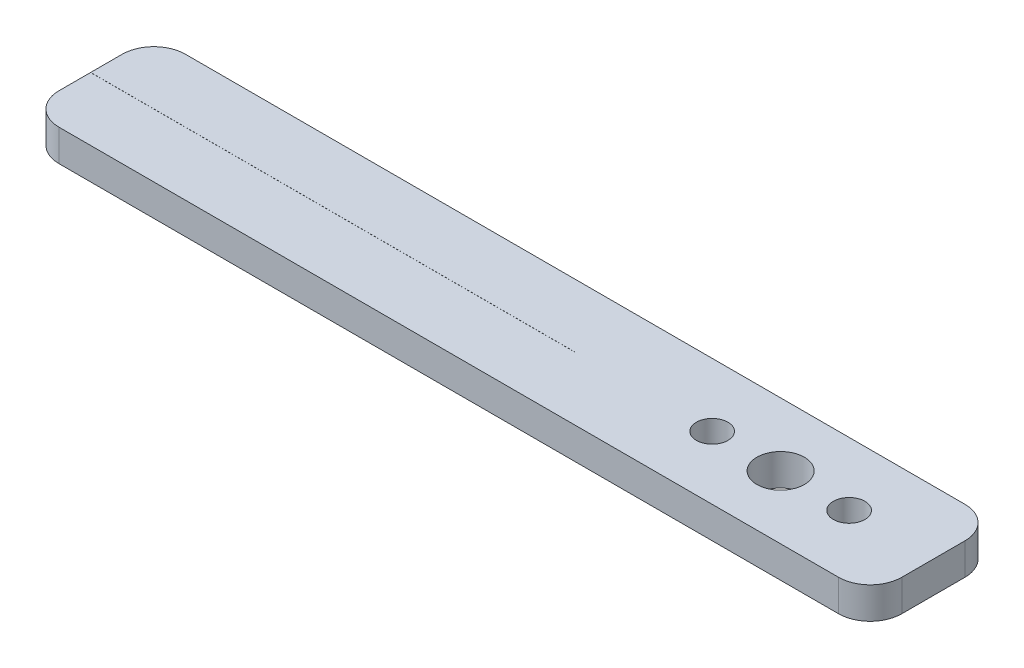
ISO-10303-21;
HEADER;
FILE_DESCRIPTION(('STEP AP214'),'2;1');
FILE_NAME('part.step','',(''),(''),'','','');
FILE_SCHEMA(('AUTOMOTIVE_DESIGN { 1 0 10303 214 1 1 1 1 }'));
ENDSEC;
DATA;
#1=APPLICATION_CONTEXT('core data for automotive mechanical design processes');
#2=APPLICATION_PROTOCOL_DEFINITION('international standard','automotive_design',2000,#1);
#3=PRODUCT_CONTEXT('',#1,'mechanical');
#4=PRODUCT('Part','Part','',(#3));
#5=PRODUCT_RELATED_PRODUCT_CATEGORY('part','',(#4));
#6=PRODUCT_DEFINITION_FORMATION('','',#4);
#7=PRODUCT_DEFINITION_CONTEXT('part definition',#1,'design');
#8=PRODUCT_DEFINITION('design','',#6,#7);
#9=PRODUCT_DEFINITION_SHAPE('','',#8);
#10=(LENGTH_UNIT() NAMED_UNIT(*) SI_UNIT(.MILLI.,.METRE.));
#11=(NAMED_UNIT(*) PLANE_ANGLE_UNIT() SI_UNIT($,.RADIAN.));
#12=(NAMED_UNIT(*) SI_UNIT($,.STERADIAN.) SOLID_ANGLE_UNIT());
#13=UNCERTAINTY_MEASURE_WITH_UNIT(LENGTH_MEASURE(1.E-05),#10,'distance_accuracy_value','');
#14=(GEOMETRIC_REPRESENTATION_CONTEXT(3) GLOBAL_UNCERTAINTY_ASSIGNED_CONTEXT((#13)) GLOBAL_UNIT_ASSIGNED_CONTEXT((#10,
#11,#12)) REPRESENTATION_CONTEXT('',''));
#15=CARTESIAN_POINT('',(0.,0.,0.));
#16=DIRECTION('',(0.,0.,1.));
#17=DIRECTION('',(1.,0.,0.));
#18=AXIS2_PLACEMENT_3D('',#15,#16,#17);
#19=CARTESIAN_POINT('',(-40.,3.,-0.999999999999979));
#20=DIRECTION('',(1.,0.,0.));
#21=DIRECTION('',(0.,0.,-1.));
#22=AXIS2_PLACEMENT_3D('',#19,#20,#21);
#23=PLANE('',#22);
#24=DIRECTION('',(0.,0.,1.));
#25=VECTOR('',#24,1.);
#26=CARTESIAN_POINT('',(-40.,0.,-0.999999999999979));
#27=LINE('',#26,#25);
#28=CARTESIAN_POINT('',(-40.,0.,-0.999999999999979));
#29=VERTEX_POINT('',#28);
#30=CARTESIAN_POINT('',(-40.,0.,1.995));
#31=VERTEX_POINT('',#30);
#32=EDGE_CURVE('E149',#29,#31,#27,.T.);
#33=ORIENTED_EDGE('',*,*,#32,.T.);
#34=DIRECTION('',(0.,1.,0.));
#35=VECTOR('',#34,1.);
#36=CARTESIAN_POINT('',(-40.,0.,1.995));
#37=LINE('',#36,#35);
#38=CARTESIAN_POINT('',(-40.,3.,1.995));
#39=VERTEX_POINT('',#38);
#40=EDGE_CURVE('E213',#31,#39,#37,.T.);
#41=ORIENTED_EDGE('',*,*,#40,.T.);
#42=DIRECTION('',(0.,0.,1.));
#43=VECTOR('',#42,1.);
#44=CARTESIAN_POINT('',(-40.,3.,-0.999999999999979));
#45=LINE('',#44,#43);
#46=CARTESIAN_POINT('',(-40.,3.,-0.999999999999979));
#47=VERTEX_POINT('',#46);
#48=EDGE_CURVE('E96',#47,#39,#45,.T.);
#49=ORIENTED_EDGE('',*,*,#48,.F.);
#50=DIRECTION('',(0.,-1.,0.));
#51=VECTOR('',#50,1.);
#52=CARTESIAN_POINT('',(-40.,3.,-0.999999999999979));
#53=LINE('',#52,#51);
#54=EDGE_CURVE('E11',#47,#29,#53,.T.);
#55=ORIENTED_EDGE('',*,*,#54,.T.);
#56=EDGE_LOOP('',(#33,#41,#49,#55));
#57=FACE_BOUND('',#56,.T.);
#58=ADVANCED_FACE('F33',(#57),#23,.F.);
#59=CARTESIAN_POINT('',(-37.,3.,-1.));
#60=DIRECTION('',(0.,-1.,0.));
#61=DIRECTION('',(0.,0.,-1.));
#62=AXIS2_PLACEMENT_3D('',#59,#60,#61);
#63=CYLINDRICAL_SURFACE('',#62,3.);
#64=CARTESIAN_POINT('',(-37.,0.,-1.));
#65=DIRECTION('',(0.,1.,0.));
#66=DIRECTION('',(0.,0.,1.));
#67=AXIS2_PLACEMENT_3D('',#64,#65,#66);
#68=CIRCLE('',#67,3.);
#69=CARTESIAN_POINT('',(-37.,0.,-4.));
#70=VERTEX_POINT('',#69);
#71=EDGE_CURVE('E145',#70,#29,#68,.T.);
#72=ORIENTED_EDGE('',*,*,#71,.T.);
#73=ORIENTED_EDGE('',*,*,#54,.F.);
#74=CARTESIAN_POINT('',(-37.,3.,-1.));
#75=DIRECTION('',(0.,1.,0.));
#76=DIRECTION('',(0.,0.,1.));
#77=AXIS2_PLACEMENT_3D('',#74,#75,#76);
#78=CIRCLE('',#77,3.);
#79=CARTESIAN_POINT('',(-37.,3.,-4.));
#80=VERTEX_POINT('',#79);
#81=EDGE_CURVE('E165',#80,#47,#78,.T.);
#82=ORIENTED_EDGE('',*,*,#81,.F.);
#83=DIRECTION('',(0.,-1.,0.));
#84=VECTOR('',#83,1.);
#85=CARTESIAN_POINT('',(-37.,3.,-4.));
#86=LINE('',#85,#84);
#87=EDGE_CURVE('E57',#80,#70,#86,.T.);
#88=ORIENTED_EDGE('',*,*,#87,.T.);
#89=EDGE_LOOP('',(#72,#73,#82,#88));
#90=FACE_BOUND('',#89,.T.);
#91=ADVANCED_FACE('F35',(#90),#63,.T.);
#92=CARTESIAN_POINT('',(-40.,3.,2.005));
#93=VERTEX_POINT('',#92);
#94=CARTESIAN_POINT('',(-40.,3.,5.));
#95=VERTEX_POINT('',#94);
#96=EDGE_CURVE('E202',#93,#95,#45,.T.);
#97=ORIENTED_EDGE('',*,*,#96,.F.);
#98=DIRECTION('',(0.,1.,0.));
#99=VECTOR('',#98,1.);
#100=CARTESIAN_POINT('',(-40.,0.,2.005));
#101=LINE('',#100,#99);
#102=CARTESIAN_POINT('',(-40.,0.,2.005));
#103=VERTEX_POINT('',#102);
#104=EDGE_CURVE('E204',#103,#93,#101,.T.);
#105=ORIENTED_EDGE('',*,*,#104,.F.);
#106=CARTESIAN_POINT('',(-40.,0.,5.));
#107=VERTEX_POINT('',#106);
#108=EDGE_CURVE('E147',#103,#107,#27,.T.);
#109=ORIENTED_EDGE('',*,*,#108,.T.);
#110=DIRECTION('',(0.,-1.,0.));
#111=VECTOR('',#110,1.);
#112=CARTESIAN_POINT('',(-40.,3.,5.));
#113=LINE('',#112,#111);
#114=EDGE_CURVE('E41',#95,#107,#113,.T.);
#115=ORIENTED_EDGE('',*,*,#114,.F.);
#116=EDGE_LOOP('',(#97,#105,#109,#115));
#117=FACE_BOUND('',#116,.T.);
#118=ADVANCED_FACE('F281',(#117),#23,.F.);
#119=CARTESIAN_POINT('',(-37.,3.,5.));
#120=DIRECTION('',(0.,-1.,0.));
#121=DIRECTION('',(0.,0.,-1.));
#122=AXIS2_PLACEMENT_3D('',#119,#120,#121);
#123=CYLINDRICAL_SURFACE('',#122,3.);
#124=CARTESIAN_POINT('',(-37.,0.,5.));
#125=DIRECTION('',(0.,1.,0.));
#126=DIRECTION('',(0.,0.,1.));
#127=AXIS2_PLACEMENT_3D('',#124,#125,#126);
#128=CIRCLE('',#127,3.);
#129=CARTESIAN_POINT('',(-37.,0.,8.));
#130=VERTEX_POINT('',#129);
#131=EDGE_CURVE('E152',#107,#130,#128,.T.);
#132=ORIENTED_EDGE('',*,*,#131,.T.);
#133=DIRECTION('',(0.,-1.,0.));
#134=VECTOR('',#133,1.);
#135=CARTESIAN_POINT('',(-37.,3.,8.));
#136=LINE('',#135,#134);
#137=CARTESIAN_POINT('',(-37.,3.,8.));
#138=VERTEX_POINT('',#137);
#139=EDGE_CURVE('E172',#138,#130,#136,.T.);
#140=ORIENTED_EDGE('',*,*,#139,.F.);
#141=CARTESIAN_POINT('',(-37.,3.,5.));
#142=DIRECTION('',(0.,1.,0.));
#143=DIRECTION('',(0.,0.,1.));
#144=AXIS2_PLACEMENT_3D('',#141,#142,#143);
#145=CIRCLE('',#144,3.);
#146=EDGE_CURVE('E181',#95,#138,#145,.T.);
#147=ORIENTED_EDGE('',*,*,#146,.F.);
#148=ORIENTED_EDGE('',*,*,#114,.T.);
#149=EDGE_LOOP('',(#132,#140,#147,#148));
#150=FACE_BOUND('',#149,.T.);
#151=ADVANCED_FACE('F179',(#150),#123,.T.);
#152=CARTESIAN_POINT('',(-37.,3.,8.));
#153=DIRECTION('',(0.,0.,-1.));
#154=DIRECTION('',(-1.,0.,0.));
#155=AXIS2_PLACEMENT_3D('',#152,#153,#154);
#156=PLANE('',#155);
#157=DIRECTION('',(1.,0.,0.));
#158=VECTOR('',#157,1.);
#159=CARTESIAN_POINT('',(-37.,0.,8.));
#160=LINE('',#159,#158);
#161=CARTESIAN_POINT('',(37.,0.,8.));
#162=VERTEX_POINT('',#161);
#163=EDGE_CURVE('E154',#130,#162,#160,.T.);
#164=ORIENTED_EDGE('',*,*,#163,.T.);
#165=DIRECTION('',(0.,-1.,0.));
#166=VECTOR('',#165,1.);
#167=CARTESIAN_POINT('',(37.,3.,8.));
#168=LINE('',#167,#166);
#169=CARTESIAN_POINT('',(37.,3.,8.));
#170=VERTEX_POINT('',#169);
#171=EDGE_CURVE('E169',#170,#162,#168,.T.);
#172=ORIENTED_EDGE('',*,*,#171,.F.);
#173=DIRECTION('',(1.,0.,0.));
#174=VECTOR('',#173,1.);
#175=CARTESIAN_POINT('',(-37.,3.,8.));
#176=LINE('',#175,#174);
#177=EDGE_CURVE('E197',#138,#170,#176,.T.);
#178=ORIENTED_EDGE('',*,*,#177,.F.);
#179=ORIENTED_EDGE('',*,*,#139,.T.);
#180=EDGE_LOOP('',(#164,#172,#178,#179));
#181=FACE_BOUND('',#180,.T.);
#182=ADVANCED_FACE('F193',(#181),#156,.F.);
#183=CARTESIAN_POINT('',(37.,3.,5.));
#184=DIRECTION('',(0.,-1.,0.));
#185=DIRECTION('',(0.,0.,-1.));
#186=AXIS2_PLACEMENT_3D('',#183,#184,#185);
#187=CYLINDRICAL_SURFACE('',#186,3.);
#188=CARTESIAN_POINT('',(37.,0.,5.));
#189=DIRECTION('',(0.,1.,0.));
#190=DIRECTION('',(0.,0.,1.));
#191=AXIS2_PLACEMENT_3D('',#188,#189,#190);
#192=CIRCLE('',#191,3.);
#193=CARTESIAN_POINT('',(40.,0.,5.));
#194=VERTEX_POINT('',#193);
#195=EDGE_CURVE('E156',#162,#194,#192,.T.);
#196=ORIENTED_EDGE('',*,*,#195,.T.);
#197=DIRECTION('',(0.,-1.,0.));
#198=VECTOR('',#197,1.);
#199=CARTESIAN_POINT('',(40.,3.,5.));
#200=LINE('',#199,#198);
#201=CARTESIAN_POINT('',(40.,3.,5.));
#202=VERTEX_POINT('',#201);
#203=EDGE_CURVE('E126',#202,#194,#200,.T.);
#204=ORIENTED_EDGE('',*,*,#203,.F.);
#205=CARTESIAN_POINT('',(37.,3.,5.));
#206=DIRECTION('',(0.,1.,0.));
#207=DIRECTION('',(0.,0.,1.));
#208=AXIS2_PLACEMENT_3D('',#205,#206,#207);
#209=CIRCLE('',#208,3.);
#210=EDGE_CURVE('E136',#170,#202,#209,.T.);
#211=ORIENTED_EDGE('',*,*,#210,.F.);
#212=ORIENTED_EDGE('',*,*,#171,.T.);
#213=EDGE_LOOP('',(#196,#204,#211,#212));
#214=FACE_BOUND('',#213,.T.);
#215=ADVANCED_FACE('F196',(#214),#187,.T.);
#216=CARTESIAN_POINT('',(40.,3.,-0.999999999999979));
#217=DIRECTION('',(1.,0.,0.));
#218=DIRECTION('',(0.,0.,-1.));
#219=AXIS2_PLACEMENT_3D('',#216,#217,#218);
#220=PLANE('',#219);
#221=DIRECTION('',(0.,0.,1.));
#222=VECTOR('',#221,1.);
#223=CARTESIAN_POINT('',(40.,0.,-0.999999999999979));
#224=LINE('',#223,#222);
#225=CARTESIAN_POINT('',(40.,0.,-0.999999999999979));
#226=VERTEX_POINT('',#225);
#227=EDGE_CURVE('E121',#226,#194,#224,.T.);
#228=ORIENTED_EDGE('',*,*,#227,.F.);
#229=DIRECTION('',(0.,-1.,0.));
#230=VECTOR('',#229,1.);
#231=CARTESIAN_POINT('',(40.,3.,-0.999999999999979));
#232=LINE('',#231,#230);
#233=CARTESIAN_POINT('',(40.,3.,-0.999999999999979));
#234=VERTEX_POINT('',#233);
#235=EDGE_CURVE('E116',#234,#226,#232,.T.);
#236=ORIENTED_EDGE('',*,*,#235,.F.);
#237=DIRECTION('',(0.,0.,1.));
#238=VECTOR('',#237,1.);
#239=CARTESIAN_POINT('',(40.,3.,-0.999999999999979));
#240=LINE('',#239,#238);
#241=EDGE_CURVE('E119',#234,#202,#240,.T.);
#242=ORIENTED_EDGE('',*,*,#241,.T.);
#243=ORIENTED_EDGE('',*,*,#203,.T.);
#244=EDGE_LOOP('',(#228,#236,#242,#243));
#245=FACE_BOUND('',#244,.T.);
#246=ADVANCED_FACE('F118',(#245),#220,.T.);
#247=CARTESIAN_POINT('',(37.,3.,-1.));
#248=DIRECTION('',(0.,-1.,0.));
#249=DIRECTION('',(0.,0.,-1.));
#250=AXIS2_PLACEMENT_3D('',#247,#248,#249);
#251=CYLINDRICAL_SURFACE('',#250,3.);
#252=CARTESIAN_POINT('',(37.,0.,-1.));
#253=DIRECTION('',(0.,-1.,0.));
#254=DIRECTION('',(0.,0.,-1.));
#255=AXIS2_PLACEMENT_3D('',#252,#253,#254);
#256=CIRCLE('',#255,3.);
#257=CARTESIAN_POINT('',(37.,0.,-4.));
#258=VERTEX_POINT('',#257);
#259=EDGE_CURVE('E160',#258,#226,#256,.T.);
#260=ORIENTED_EDGE('',*,*,#259,.F.);
#261=DIRECTION('',(0.,-1.,0.));
#262=VECTOR('',#261,1.);
#263=CARTESIAN_POINT('',(37.,3.,-4.));
#264=LINE('',#263,#262);
#265=CARTESIAN_POINT('',(37.,3.,-4.));
#266=VERTEX_POINT('',#265);
#267=EDGE_CURVE('E127',#266,#258,#264,.T.);
#268=ORIENTED_EDGE('',*,*,#267,.F.);
#269=CARTESIAN_POINT('',(37.,3.,-1.));
#270=DIRECTION('',(0.,-1.,0.));
#271=DIRECTION('',(0.,0.,-1.));
#272=AXIS2_PLACEMENT_3D('',#269,#270,#271);
#273=CIRCLE('',#272,3.);
#274=EDGE_CURVE('E134',#266,#234,#273,.T.);
#275=ORIENTED_EDGE('',*,*,#274,.T.);
#276=ORIENTED_EDGE('',*,*,#235,.T.);
#277=EDGE_LOOP('',(#260,#268,#275,#276));
#278=FACE_BOUND('',#277,.T.);
#279=ADVANCED_FACE('F139',(#278),#251,.T.);
#280=CARTESIAN_POINT('',(-37.,3.,-4.));
#281=DIRECTION('',(0.,0.,-1.));
#282=DIRECTION('',(-1.,0.,0.));
#283=AXIS2_PLACEMENT_3D('',#280,#281,#282);
#284=PLANE('',#283);
#285=DIRECTION('',(1.,0.,0.));
#286=VECTOR('',#285,1.);
#287=CARTESIAN_POINT('',(-37.,0.,-4.));
#288=LINE('',#287,#286);
#289=EDGE_CURVE('E162',#70,#258,#288,.T.);
#290=ORIENTED_EDGE('',*,*,#289,.F.);
#291=ORIENTED_EDGE('',*,*,#87,.F.);
#292=DIRECTION('',(1.,0.,0.));
#293=VECTOR('',#292,1.);
#294=CARTESIAN_POINT('',(-37.,3.,-4.));
#295=LINE('',#294,#293);
#296=EDGE_CURVE('E140',#80,#266,#295,.T.);
#297=ORIENTED_EDGE('',*,*,#296,.T.);
#298=ORIENTED_EDGE('',*,*,#267,.T.);
#299=EDGE_LOOP('',(#290,#291,#297,#298));
#300=FACE_BOUND('',#299,.T.);
#301=ADVANCED_FACE('F258',(#300),#284,.T.);
#302=CARTESIAN_POINT('',(-37.,3.,-1.));
#303=DIRECTION('',(0.,1.,0.));
#304=DIRECTION('',(0.,0.,1.));
#305=AXIS2_PLACEMENT_3D('',#302,#303,#304);
#306=PLANE('',#305);
#307=CARTESIAN_POINT('',(32.,3.,2.));
#308=DIRECTION('',(0.,1.,0.));
#309=DIRECTION('',(0.,0.,1.));
#310=AXIS2_PLACEMENT_3D('',#307,#308,#309);
#311=CIRCLE('',#310,1.5);
#312=CARTESIAN_POINT('',(32.,3.,3.5));
#313=VERTEX_POINT('',#312);
#314=EDGE_CURVE('E241',#313,#313,#311,.T.);
#315=ORIENTED_EDGE('',*,*,#314,.F.);
#316=EDGE_LOOP('',(#315));
#317=FACE_BOUND('',#316,.T.);
#318=CARTESIAN_POINT('',(25.5,3.,2.));
#319=DIRECTION('',(0.,1.,0.));
#320=DIRECTION('',(0.,0.,1.));
#321=AXIS2_PLACEMENT_3D('',#318,#319,#320);
#322=CIRCLE('',#321,2.25);
#323=CARTESIAN_POINT('',(25.5,3.,4.25));
#324=VERTEX_POINT('',#323);
#325=EDGE_CURVE('E235',#324,#324,#322,.T.);
#326=ORIENTED_EDGE('',*,*,#325,.F.);
#327=EDGE_LOOP('',(#326));
#328=FACE_BOUND('',#327,.T.);
#329=CARTESIAN_POINT('',(19.,3.,2.));
#330=DIRECTION('',(0.,1.,0.));
#331=DIRECTION('',(0.,0.,-1.));
#332=AXIS2_PLACEMENT_3D('',#329,#330,#331);
#333=CIRCLE('',#332,1.49999999999999);
#334=CARTESIAN_POINT('',(19.,3.,0.500000000000008));
#335=VERTEX_POINT('',#334);
#336=EDGE_CURVE('E215',#335,#335,#333,.T.);
#337=ORIENTED_EDGE('',*,*,#336,.F.);
#338=EDGE_LOOP('',(#337));
#339=FACE_BOUND('',#338,.T.);
#340=DIRECTION('',(-1.,0.,0.));
#341=VECTOR('',#340,1.);
#342=CARTESIAN_POINT('',(-40.,3.,1.995));
#343=LINE('',#342,#341);
#344=CARTESIAN_POINT('',(5.95257514096274,3.,1.995));
#345=VERTEX_POINT('',#344);
#346=EDGE_CURVE('E216',#345,#39,#343,.T.);
#347=ORIENTED_EDGE('',*,*,#346,.F.);
#348=DIRECTION('',(0.,0.,-1.));
#349=VECTOR('',#348,1.);
#350=CARTESIAN_POINT('',(5.95257514096274,3.,2.005));
#351=LINE('',#350,#349);
#352=CARTESIAN_POINT('',(5.95257514096274,3.,2.005));
#353=VERTEX_POINT('',#352);
#354=EDGE_CURVE('E220',#353,#345,#351,.T.);
#355=ORIENTED_EDGE('',*,*,#354,.F.);
#356=DIRECTION('',(1.,0.,0.));
#357=VECTOR('',#356,1.);
#358=CARTESIAN_POINT('',(-40.,3.,2.005));
#359=LINE('',#358,#357);
#360=EDGE_CURVE('E223',#93,#353,#359,.T.);
#361=ORIENTED_EDGE('',*,*,#360,.F.);
#362=ORIENTED_EDGE('',*,*,#96,.T.);
#363=ORIENTED_EDGE('',*,*,#146,.T.);
#364=ORIENTED_EDGE('',*,*,#177,.T.);
#365=ORIENTED_EDGE('',*,*,#210,.T.);
#366=ORIENTED_EDGE('',*,*,#241,.F.);
#367=ORIENTED_EDGE('',*,*,#274,.F.);
#368=ORIENTED_EDGE('',*,*,#296,.F.);
#369=ORIENTED_EDGE('',*,*,#81,.T.);
#370=ORIENTED_EDGE('',*,*,#48,.T.);
#371=EDGE_LOOP('',(#347,#355,#361,#362,#363,#364,#365,#366,#367,#368,#369,#370));
#372=FACE_BOUND('',#371,.T.);
#373=ADVANCED_FACE('F132',(#317,#328,#339,#372),#306,.T.);
#374=CARTESIAN_POINT('',(-37.,0.,-1.));
#375=DIRECTION('',(0.,1.,0.));
#376=DIRECTION('',(0.,0.,1.));
#377=AXIS2_PLACEMENT_3D('',#374,#375,#376);
#378=PLANE('',#377);
#379=CARTESIAN_POINT('',(32.,0.,2.));
#380=DIRECTION('',(0.,1.,0.));
#381=DIRECTION('',(0.,0.,1.));
#382=AXIS2_PLACEMENT_3D('',#379,#380,#381);
#383=CIRCLE('',#382,1.5);
#384=CARTESIAN_POINT('',(32.,0.,3.5));
#385=VERTEX_POINT('',#384);
#386=EDGE_CURVE('E148',#385,#385,#383,.T.);
#387=ORIENTED_EDGE('',*,*,#386,.T.);
#388=EDGE_LOOP('',(#387));
#389=FACE_BOUND('',#388,.T.);
#390=CARTESIAN_POINT('',(25.5,0.,2.));
#391=DIRECTION('',(0.,1.,0.));
#392=DIRECTION('',(0.,0.,1.));
#393=AXIS2_PLACEMENT_3D('',#390,#391,#392);
#394=CIRCLE('',#393,2.25);
#395=CARTESIAN_POINT('',(25.5,0.,4.25));
#396=VERTEX_POINT('',#395);
#397=EDGE_CURVE('E238',#396,#396,#394,.T.);
#398=ORIENTED_EDGE('',*,*,#397,.T.);
#399=EDGE_LOOP('',(#398));
#400=FACE_BOUND('',#399,.T.);
#401=CARTESIAN_POINT('',(19.,0.,2.));
#402=DIRECTION('',(0.,1.,0.));
#403=DIRECTION('',(0.,0.,-1.));
#404=AXIS2_PLACEMENT_3D('',#401,#402,#403);
#405=CIRCLE('',#404,1.49999999999999);
#406=CARTESIAN_POINT('',(19.,0.,0.500000000000008));
#407=VERTEX_POINT('',#406);
#408=EDGE_CURVE('E232',#407,#407,#405,.T.);
#409=ORIENTED_EDGE('',*,*,#408,.T.);
#410=EDGE_LOOP('',(#409));
#411=FACE_BOUND('',#410,.T.);
#412=DIRECTION('',(0.,0.,-1.));
#413=VECTOR('',#412,1.);
#414=CARTESIAN_POINT('',(5.95257514096274,0.,2.005));
#415=LINE('',#414,#413);
#416=CARTESIAN_POINT('',(5.95257514096274,0.,2.005));
#417=VERTEX_POINT('',#416);
#418=CARTESIAN_POINT('',(5.95257514096274,0.,1.995));
#419=VERTEX_POINT('',#418);
#420=EDGE_CURVE('E48',#417,#419,#415,.T.);
#421=ORIENTED_EDGE('',*,*,#420,.T.);
#422=DIRECTION('',(-1.,0.,0.));
#423=VECTOR('',#422,1.);
#424=CARTESIAN_POINT('',(-40.,0.,1.995));
#425=LINE('',#424,#423);
#426=EDGE_CURVE('E208',#419,#31,#425,.T.);
#427=ORIENTED_EDGE('',*,*,#426,.T.);
#428=ORIENTED_EDGE('',*,*,#32,.F.);
#429=ORIENTED_EDGE('',*,*,#71,.F.);
#430=ORIENTED_EDGE('',*,*,#289,.T.);
#431=ORIENTED_EDGE('',*,*,#259,.T.);
#432=ORIENTED_EDGE('',*,*,#227,.T.);
#433=ORIENTED_EDGE('',*,*,#195,.F.);
#434=ORIENTED_EDGE('',*,*,#163,.F.);
#435=ORIENTED_EDGE('',*,*,#131,.F.);
#436=ORIENTED_EDGE('',*,*,#108,.F.);
#437=DIRECTION('',(1.,0.,0.));
#438=VECTOR('',#437,1.);
#439=CARTESIAN_POINT('',(-40.,0.,2.005));
#440=LINE('',#439,#438);
#441=EDGE_CURVE('E219',#103,#417,#440,.T.);
#442=ORIENTED_EDGE('',*,*,#441,.T.);
#443=EDGE_LOOP('',(#421,#427,#428,#429,#430,#431,#432,#433,#434,#435,#436,#442));
#444=FACE_BOUND('',#443,.T.);
#445=ADVANCED_FACE('F187',(#389,#400,#411,#444),#378,.F.);
#446=CARTESIAN_POINT('',(-40.,0.,1.995));
#447=DIRECTION('',(0.,0.,-1.));
#448=DIRECTION('',(-1.,0.,0.));
#449=AXIS2_PLACEMENT_3D('',#446,#447,#448);
#450=PLANE('',#449);
#451=ORIENTED_EDGE('',*,*,#346,.T.);
#452=ORIENTED_EDGE('',*,*,#40,.F.);
#453=ORIENTED_EDGE('',*,*,#426,.F.);
#454=DIRECTION('',(0.,1.,0.));
#455=VECTOR('',#454,1.);
#456=CARTESIAN_POINT('',(5.95257514096274,0.,1.995));
#457=LINE('',#456,#455);
#458=EDGE_CURVE('E210',#419,#345,#457,.T.);
#459=ORIENTED_EDGE('',*,*,#458,.T.);
#460=EDGE_LOOP('',(#451,#452,#453,#459));
#461=FACE_BOUND('',#460,.T.);
#462=ADVANCED_FACE('F305',(#461),#450,.F.);
#463=CARTESIAN_POINT('',(5.95257514096274,0.,2.005));
#464=DIRECTION('',(1.,0.,0.));
#465=DIRECTION('',(0.,0.,-1.));
#466=AXIS2_PLACEMENT_3D('',#463,#464,#465);
#467=PLANE('',#466);
#468=ORIENTED_EDGE('',*,*,#354,.T.);
#469=ORIENTED_EDGE('',*,*,#458,.F.);
#470=ORIENTED_EDGE('',*,*,#420,.F.);
#471=DIRECTION('',(0.,1.,0.));
#472=VECTOR('',#471,1.);
#473=CARTESIAN_POINT('',(5.95257514096274,0.,2.005));
#474=LINE('',#473,#472);
#475=EDGE_CURVE('E207',#417,#353,#474,.T.);
#476=ORIENTED_EDGE('',*,*,#475,.T.);
#477=EDGE_LOOP('',(#468,#469,#470,#476));
#478=FACE_BOUND('',#477,.T.);
#479=ADVANCED_FACE('F275',(#478),#467,.F.);
#480=CARTESIAN_POINT('',(-40.,0.,2.005));
#481=DIRECTION('',(0.,0.,1.));
#482=DIRECTION('',(1.,0.,0.));
#483=AXIS2_PLACEMENT_3D('',#480,#481,#482);
#484=PLANE('',#483);
#485=ORIENTED_EDGE('',*,*,#360,.T.);
#486=ORIENTED_EDGE('',*,*,#475,.F.);
#487=ORIENTED_EDGE('',*,*,#441,.F.);
#488=ORIENTED_EDGE('',*,*,#104,.T.);
#489=EDGE_LOOP('',(#485,#486,#487,#488));
#490=FACE_BOUND('',#489,.T.);
#491=ADVANCED_FACE('F266',(#490),#484,.F.);
#492=CARTESIAN_POINT('',(19.,0.,2.));
#493=DIRECTION('',(0.,1.,0.));
#494=DIRECTION('',(0.,0.,1.));
#495=AXIS2_PLACEMENT_3D('',#492,#493,#494);
#496=CYLINDRICAL_SURFACE('',#495,1.49999999999999);
#497=ORIENTED_EDGE('',*,*,#408,.F.);
#498=EDGE_LOOP('',(#497));
#499=FACE_BOUND('',#498,.T.);
#500=ORIENTED_EDGE('',*,*,#336,.T.);
#501=EDGE_LOOP('',(#500));
#502=FACE_BOUND('',#501,.T.);
#503=ADVANCED_FACE('F264',(#499,#502),#496,.F.);
#504=CARTESIAN_POINT('',(25.5,0.,2.));
#505=DIRECTION('',(0.,1.,0.));
#506=DIRECTION('',(0.,0.,1.));
#507=AXIS2_PLACEMENT_3D('',#504,#505,#506);
#508=CYLINDRICAL_SURFACE('',#507,2.25);
#509=ORIENTED_EDGE('',*,*,#397,.F.);
#510=EDGE_LOOP('',(#509));
#511=FACE_BOUND('',#510,.T.);
#512=ORIENTED_EDGE('',*,*,#325,.T.);
#513=EDGE_LOOP('',(#512));
#514=FACE_BOUND('',#513,.T.);
#515=ADVANCED_FACE('F252',(#511,#514),#508,.F.);
#516=CARTESIAN_POINT('',(32.,0.,2.));
#517=DIRECTION('',(0.,1.,0.));
#518=DIRECTION('',(0.,0.,1.));
#519=AXIS2_PLACEMENT_3D('',#516,#517,#518);
#520=CYLINDRICAL_SURFACE('',#519,1.5);
#521=ORIENTED_EDGE('',*,*,#386,.F.);
#522=EDGE_LOOP('',(#521));
#523=FACE_BOUND('',#522,.T.);
#524=ORIENTED_EDGE('',*,*,#314,.T.);
#525=EDGE_LOOP('',(#524));
#526=FACE_BOUND('',#525,.T.);
#527=ADVANCED_FACE('F249',(#523,#526),#520,.F.);
#528=CLOSED_SHELL('',(#58,#91,#118,#151,#182,#215,#246,#279,#301,#373,#445,#462,#479,#491,#503,
#515,#527));
#529=MANIFOLD_SOLID_BREP('B2',#528);
#530=ADVANCED_BREP_SHAPE_REPRESENTATION('',(#18,#529),#14);
#531=SHAPE_DEFINITION_REPRESENTATION(#9,#530);
ENDSEC;
END-ISO-10303-21;
